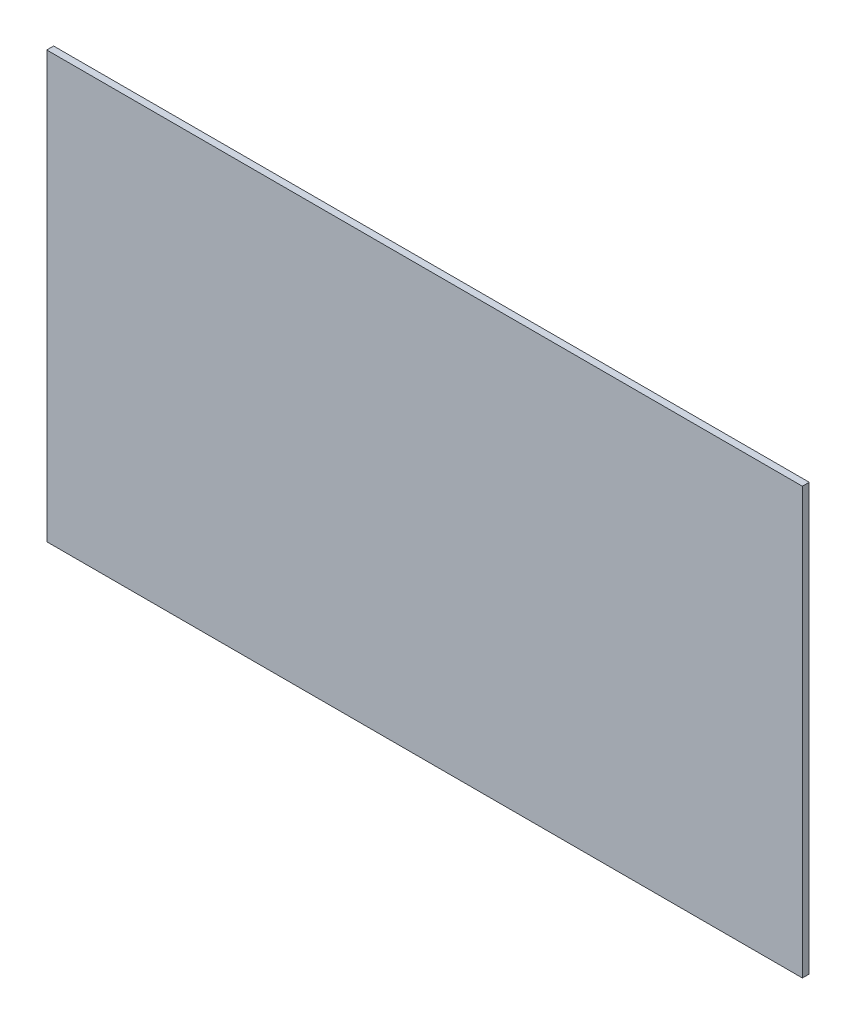
ISO-10303-21;
HEADER;
FILE_DESCRIPTION(('STEP AP214'),'2;1');
FILE_NAME('part.step','',(''),(''),'','','');
FILE_SCHEMA(('AUTOMOTIVE_DESIGN { 1 0 10303 214 1 1 1 1 }'));
ENDSEC;
DATA;
#1=APPLICATION_CONTEXT('core data for automotive mechanical design processes');
#2=APPLICATION_PROTOCOL_DEFINITION('international standard','automotive_design',2000,#1);
#3=PRODUCT_CONTEXT('',#1,'mechanical');
#4=PRODUCT('Part','Part','',(#3));
#5=PRODUCT_RELATED_PRODUCT_CATEGORY('part','',(#4));
#6=PRODUCT_DEFINITION_FORMATION('','',#4);
#7=PRODUCT_DEFINITION_CONTEXT('part definition',#1,'design');
#8=PRODUCT_DEFINITION('design','',#6,#7);
#9=PRODUCT_DEFINITION_SHAPE('','',#8);
#10=(LENGTH_UNIT() NAMED_UNIT(*) SI_UNIT(.MILLI.,.METRE.));
#11=(NAMED_UNIT(*) PLANE_ANGLE_UNIT() SI_UNIT($,.RADIAN.));
#12=(NAMED_UNIT(*) SI_UNIT($,.STERADIAN.) SOLID_ANGLE_UNIT());
#13=UNCERTAINTY_MEASURE_WITH_UNIT(LENGTH_MEASURE(1.E-05),#10,'distance_accuracy_value','');
#14=(GEOMETRIC_REPRESENTATION_CONTEXT(3) GLOBAL_UNCERTAINTY_ASSIGNED_CONTEXT((#13)) GLOBAL_UNIT_ASSIGNED_CONTEXT((#10,
#11,#12)) REPRESENTATION_CONTEXT('',''));
#15=CARTESIAN_POINT('',(0.,0.,0.));
#16=DIRECTION('',(0.,0.,1.));
#17=DIRECTION('',(1.,0.,0.));
#18=AXIS2_PLACEMENT_3D('',#15,#16,#17);
#19=CARTESIAN_POINT('',(78.8048090785182,259.383312432681,0.127000000001765));
#20=DIRECTION('',(-1.,0.,0.));
#21=DIRECTION('',(0.,-1.,0.));
#22=AXIS2_PLACEMENT_3D('',#19,#20,#21);
#23=PLANE('',#22);
#24=DIRECTION('',(0.,1.,0.));
#25=VECTOR('',#24,1.);
#26=CARTESIAN_POINT('',(78.8048090785182,259.383312432682,-8.88178419700125E-12));
#27=LINE('',#26,#25);
#28=CARTESIAN_POINT('',(78.8048090785182,259.383312432682,-8.88178419700125E-12));
#29=VERTEX_POINT('',#28);
#30=CARTESIAN_POINT('',(78.8048090785182,267.257312432682,3.5527136788005E-12));
#31=VERTEX_POINT('',#30);
#32=EDGE_CURVE('E97',#29,#31,#27,.T.);
#33=ORIENTED_EDGE('',*,*,#32,.T.);
#34=DIRECTION('',(0.,0.,-1.));
#35=VECTOR('',#34,1.);
#36=CARTESIAN_POINT('',(78.8048090785182,267.257312432678,0.127000000002653));
#37=LINE('',#36,#35);
#38=CARTESIAN_POINT('',(78.8048090785182,267.257312432678,0.127000000002653));
#39=VERTEX_POINT('',#38);
#40=EDGE_CURVE('E11',#39,#31,#37,.T.);
#41=ORIENTED_EDGE('',*,*,#40,.F.);
#42=DIRECTION('',(0.,1.,0.));
#43=VECTOR('',#42,1.);
#44=CARTESIAN_POINT('',(78.8048090785182,259.383312432681,0.127000000001765));
#45=LINE('',#44,#43);
#46=CARTESIAN_POINT('',(78.8048090785182,259.383312432681,0.127000000001765));
#47=VERTEX_POINT('',#46);
#48=EDGE_CURVE('E85',#47,#39,#45,.T.);
#49=ORIENTED_EDGE('',*,*,#48,.F.);
#50=DIRECTION('',(0.,0.,-1.));
#51=VECTOR('',#50,1.);
#52=CARTESIAN_POINT('',(78.8048090785182,259.383312432681,0.127000000001765));
#53=LINE('',#52,#51);
#54=EDGE_CURVE('E93',#47,#29,#53,.T.);
#55=ORIENTED_EDGE('',*,*,#54,.T.);
#56=EDGE_LOOP('',(#33,#41,#49,#55));
#57=FACE_BOUND('',#56,.T.);
#58=ADVANCED_FACE('F34',(#57),#23,.F.);
#59=CARTESIAN_POINT('',(78.8048090785182,267.257312432678,0.127000000002653));
#60=DIRECTION('',(0.,-1.,0.));
#61=DIRECTION('',(0.,0.,-1.));
#62=AXIS2_PLACEMENT_3D('',#59,#60,#61);
#63=PLANE('',#62);
#64=DIRECTION('',(-1.,0.,0.));
#65=VECTOR('',#64,1.);
#66=CARTESIAN_POINT('',(78.8048090785182,267.257312432682,3.5527136788005E-12));
#67=LINE('',#66,#65);
#68=CARTESIAN_POINT('',(64.8348090785182,267.257312432682,3.5527136788005E-12));
#69=VERTEX_POINT('',#68);
#70=EDGE_CURVE('E89',#31,#69,#67,.T.);
#71=ORIENTED_EDGE('',*,*,#70,.T.);
#72=DIRECTION('',(0.,0.,-1.));
#73=VECTOR('',#72,1.);
#74=CARTESIAN_POINT('',(64.8348090785182,267.257312432678,0.127000000002653));
#75=LINE('',#74,#73);
#76=CARTESIAN_POINT('',(64.8348090785182,267.257312432678,0.127000000002653));
#77=VERTEX_POINT('',#76);
#78=EDGE_CURVE('E42',#77,#69,#75,.T.);
#79=ORIENTED_EDGE('',*,*,#78,.F.);
#80=DIRECTION('',(-1.,0.,0.));
#81=VECTOR('',#80,1.);
#82=CARTESIAN_POINT('',(78.8048090785182,267.257312432678,0.127000000002653));
#83=LINE('',#82,#81);
#84=EDGE_CURVE('E80',#39,#77,#83,.T.);
#85=ORIENTED_EDGE('',*,*,#84,.F.);
#86=ORIENTED_EDGE('',*,*,#40,.T.);
#87=EDGE_LOOP('',(#71,#79,#85,#86));
#88=FACE_BOUND('',#87,.T.);
#89=ADVANCED_FACE('F88',(#88),#63,.F.);
#90=CARTESIAN_POINT('',(64.8348090785182,267.257312432678,0.127000000002653));
#91=DIRECTION('',(1.,0.,0.));
#92=DIRECTION('',(0.,1.,0.));
#93=AXIS2_PLACEMENT_3D('',#90,#91,#92);
#94=PLANE('',#93);
#95=DIRECTION('',(0.,-1.,0.));
#96=VECTOR('',#95,1.);
#97=CARTESIAN_POINT('',(64.8348090785182,267.257312432682,3.5527136788005E-12));
#98=LINE('',#97,#96);
#99=CARTESIAN_POINT('',(64.8348090785182,259.383312432682,-8.88178419700125E-12));
#100=VERTEX_POINT('',#99);
#101=EDGE_CURVE('E67',#69,#100,#98,.T.);
#102=ORIENTED_EDGE('',*,*,#101,.T.);
#103=DIRECTION('',(0.,0.,-1.));
#104=VECTOR('',#103,1.);
#105=CARTESIAN_POINT('',(64.8348090785182,259.383312432681,0.127000000001765));
#106=LINE('',#105,#104);
#107=CARTESIAN_POINT('',(64.8348090785182,259.383312432681,0.127000000001765));
#108=VERTEX_POINT('',#107);
#109=EDGE_CURVE('E90',#108,#100,#106,.T.);
#110=ORIENTED_EDGE('',*,*,#109,.F.);
#111=DIRECTION('',(0.,-1.,0.));
#112=VECTOR('',#111,1.);
#113=CARTESIAN_POINT('',(64.8348090785182,267.257312432678,0.127000000002653));
#114=LINE('',#113,#112);
#115=EDGE_CURVE('E83',#77,#108,#114,.T.);
#116=ORIENTED_EDGE('',*,*,#115,.F.);
#117=ORIENTED_EDGE('',*,*,#78,.T.);
#118=EDGE_LOOP('',(#102,#110,#116,#117));
#119=FACE_BOUND('',#118,.T.);
#120=ADVANCED_FACE('F91',(#119),#94,.F.);
#121=CARTESIAN_POINT('',(64.8348090785182,259.383312432681,0.127000000001765));
#122=DIRECTION('',(0.,1.,0.));
#123=DIRECTION('',(0.,0.,1.));
#124=AXIS2_PLACEMENT_3D('',#121,#122,#123);
#125=PLANE('',#124);
#126=DIRECTION('',(1.,0.,0.));
#127=VECTOR('',#126,1.);
#128=CARTESIAN_POINT('',(64.8348090785182,259.383312432682,-8.88178419700125E-12));
#129=LINE('',#128,#127);
#130=EDGE_CURVE('E73',#100,#29,#129,.T.);
#131=ORIENTED_EDGE('',*,*,#130,.T.);
#132=ORIENTED_EDGE('',*,*,#54,.F.);
#133=DIRECTION('',(1.,0.,0.));
#134=VECTOR('',#133,1.);
#135=CARTESIAN_POINT('',(64.8348090785182,259.383312432681,0.127000000001765));
#136=LINE('',#135,#134);
#137=EDGE_CURVE('E50',#108,#47,#136,.T.);
#138=ORIENTED_EDGE('',*,*,#137,.F.);
#139=ORIENTED_EDGE('',*,*,#109,.T.);
#140=EDGE_LOOP('',(#131,#132,#138,#139));
#141=FACE_BOUND('',#140,.T.);
#142=ADVANCED_FACE('F104',(#141),#125,.F.);
#143=CARTESIAN_POINT('',(0.,1.33226762955019E-12,0.127000000000876));
#144=DIRECTION('',(0.,0.,1.));
#145=DIRECTION('',(1.,0.,0.));
#146=AXIS2_PLACEMENT_3D('',#143,#144,#145);
#147=PLANE('',#146);
#148=ORIENTED_EDGE('',*,*,#48,.T.);
#149=ORIENTED_EDGE('',*,*,#84,.T.);
#150=ORIENTED_EDGE('',*,*,#115,.T.);
#151=ORIENTED_EDGE('',*,*,#137,.T.);
#152=EDGE_LOOP('',(#148,#149,#150,#151));
#153=FACE_BOUND('',#152,.T.);
#154=ADVANCED_FACE('F81',(#153),#147,.T.);
#155=CARTESIAN_POINT('',(0.,0.,0.));
#156=DIRECTION('',(0.,0.,1.));
#157=DIRECTION('',(1.,0.,0.));
#158=AXIS2_PLACEMENT_3D('',#155,#156,#157);
#159=PLANE('',#158);
#160=ORIENTED_EDGE('',*,*,#32,.F.);
#161=ORIENTED_EDGE('',*,*,#130,.F.);
#162=ORIENTED_EDGE('',*,*,#101,.F.);
#163=ORIENTED_EDGE('',*,*,#70,.F.);
#164=EDGE_LOOP('',(#160,#161,#162,#163));
#165=FACE_BOUND('',#164,.T.);
#166=ADVANCED_FACE('F107',(#165),#159,.F.);
#167=CLOSED_SHELL('',(#58,#89,#120,#142,#154,#166));
#168=MANIFOLD_SOLID_BREP('B2',#167);
#169=ADVANCED_BREP_SHAPE_REPRESENTATION('',(#18,#168),#14);
#170=SHAPE_DEFINITION_REPRESENTATION(#9,#169);
ENDSEC;
END-ISO-10303-21;
